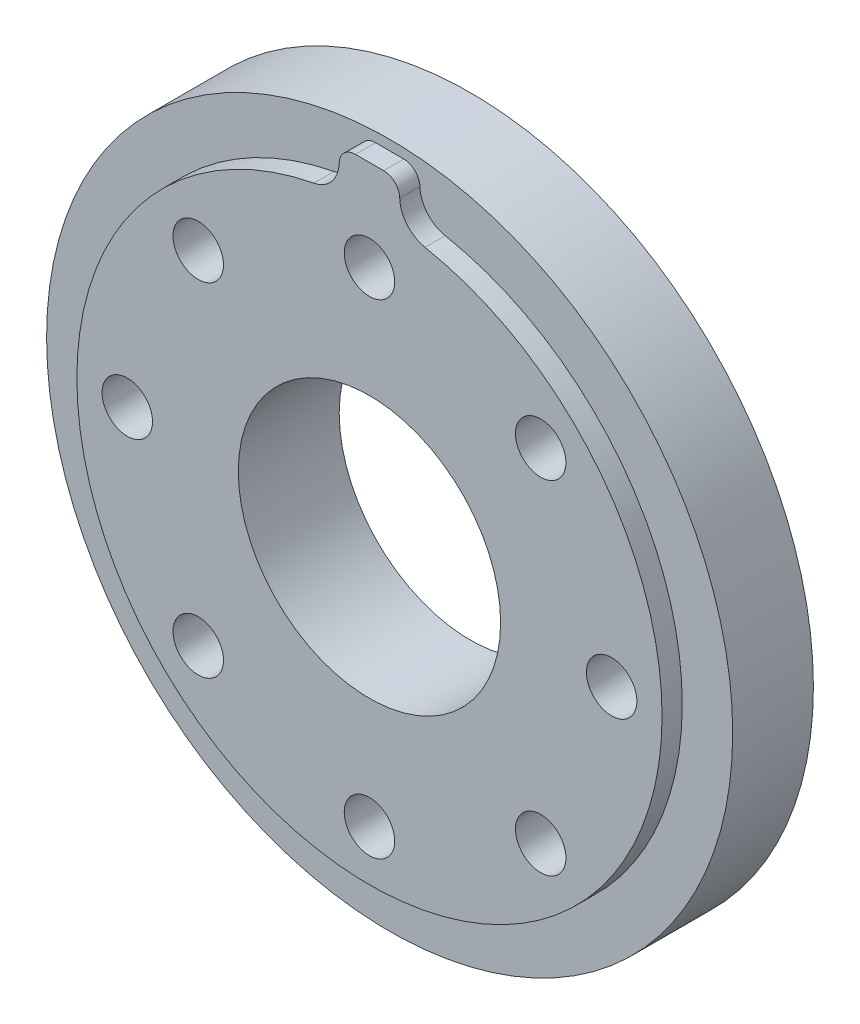
ISO-10303-21;
HEADER;
FILE_DESCRIPTION(('STEP AP214'),'2;1');
FILE_NAME('part.step','',(''),(''),'','','');
FILE_SCHEMA(('AUTOMOTIVE_DESIGN { 1 0 10303 214 1 1 1 1 }'));
ENDSEC;
DATA;
#1=APPLICATION_CONTEXT('core data for automotive mechanical design processes');
#2=APPLICATION_PROTOCOL_DEFINITION('international standard','automotive_design',2000,#1);
#3=PRODUCT_CONTEXT('',#1,'mechanical');
#4=PRODUCT('Part','Part','',(#3));
#5=PRODUCT_RELATED_PRODUCT_CATEGORY('part','',(#4));
#6=PRODUCT_DEFINITION_FORMATION('','',#4);
#7=PRODUCT_DEFINITION_CONTEXT('part definition',#1,'design');
#8=PRODUCT_DEFINITION('design','',#6,#7);
#9=PRODUCT_DEFINITION_SHAPE('','',#8);
#10=(LENGTH_UNIT() NAMED_UNIT(*) SI_UNIT(.MILLI.,.METRE.));
#11=(NAMED_UNIT(*) PLANE_ANGLE_UNIT() SI_UNIT($,.RADIAN.));
#12=(NAMED_UNIT(*) SI_UNIT($,.STERADIAN.) SOLID_ANGLE_UNIT());
#13=UNCERTAINTY_MEASURE_WITH_UNIT(LENGTH_MEASURE(1.E-05),#10,'distance_accuracy_value','');
#14=(GEOMETRIC_REPRESENTATION_CONTEXT(3) GLOBAL_UNCERTAINTY_ASSIGNED_CONTEXT((#13)) GLOBAL_UNIT_ASSIGNED_CONTEXT((#10,
#11,#12)) REPRESENTATION_CONTEXT('',''));
#15=CARTESIAN_POINT('',(0.,0.,0.));
#16=DIRECTION('',(0.,0.,1.));
#17=DIRECTION('',(1.,0.,0.));
#18=AXIS2_PLACEMENT_3D('',#15,#16,#17);
#19=CARTESIAN_POINT('',(0.,0.,4.));
#20=DIRECTION('',(0.,0.,-1.));
#21=DIRECTION('',(-1.,0.,0.));
#22=AXIS2_PLACEMENT_3D('',#19,#20,#21);
#23=CYLINDRICAL_SURFACE('',#22,17.);
#24=CARTESIAN_POINT('',(0.,0.,4.));
#25=DIRECTION('',(0.,0.,1.));
#26=DIRECTION('',(1.,0.,0.));
#27=AXIS2_PLACEMENT_3D('',#24,#25,#26);
#28=CIRCLE('',#27,17.);
#29=CARTESIAN_POINT('',(17.,0.,4.));
#30=VERTEX_POINT('',#29);
#31=EDGE_CURVE('E134',#30,#30,#28,.T.);
#32=ORIENTED_EDGE('',*,*,#31,.F.);
#33=EDGE_LOOP('',(#32));
#34=FACE_BOUND('',#33,.T.);
#35=CARTESIAN_POINT('',(0.,0.,0.));
#36=DIRECTION('',(0.,0.,1.));
#37=DIRECTION('',(1.,0.,0.));
#38=AXIS2_PLACEMENT_3D('',#35,#36,#37);
#39=CIRCLE('',#38,17.);
#40=CARTESIAN_POINT('',(17.,0.,0.));
#41=VERTEX_POINT('',#40);
#42=EDGE_CURVE('E138',#41,#41,#39,.T.);
#43=ORIENTED_EDGE('',*,*,#42,.T.);
#44=EDGE_LOOP('',(#43));
#45=FACE_BOUND('',#44,.T.);
#46=ADVANCED_FACE('F40',(#34,#45),#23,.T.);
#47=CARTESIAN_POINT('',(0.,0.,4.));
#48=DIRECTION('',(0.,0.,1.));
#49=DIRECTION('',(1.,0.,0.));
#50=AXIS2_PLACEMENT_3D('',#47,#48,#49);
#51=PLANE('',#50);
#52=CARTESIAN_POINT('',(0.,0.,4.));
#53=DIRECTION('',(0.,0.,1.));
#54=DIRECTION('',(1.,0.,0.));
#55=AXIS2_PLACEMENT_3D('',#52,#53,#54);
#56=CIRCLE('',#55,14.5);
#57=CARTESIAN_POINT('',(-2.75545171339564,14.2357818842221,4.));
#58=VERTEX_POINT('',#57);
#59=CARTESIAN_POINT('',(2.75545171339564,14.2357818842221,4.));
#60=VERTEX_POINT('',#59);
#61=EDGE_CURVE('E109',#58,#60,#56,.T.);
#62=ORIENTED_EDGE('',*,*,#61,.F.);
#63=CARTESIAN_POINT('',(-3.05,15.7575378787424,4.));
#64=DIRECTION('',(0.,0.,1.));
#65=DIRECTION('',(1.,0.,0.));
#66=AXIS2_PLACEMENT_3D('',#63,#64,#65);
#67=CIRCLE('',#66,1.55);
#68=CARTESIAN_POINT('',(-1.50046466372881,15.7195873629761,4.));
#69=VERTEX_POINT('',#68);
#70=EDGE_CURVE('E94',#58,#69,#67,.T.);
#71=ORIENTED_EDGE('',*,*,#70,.T.);
#72=CARTESIAN_POINT('',(-0.700704490169483,15.7,4.));
#73=DIRECTION('',(0.,0.,1.));
#74=DIRECTION('',(1.,0.,0.));
#75=AXIS2_PLACEMENT_3D('',#72,#73,#74);
#76=CIRCLE('',#75,0.8);
#77=CARTESIAN_POINT('',(-0.700704490169483,16.5,4.));
#78=VERTEX_POINT('',#77);
#79=EDGE_CURVE('E11',#69,#78,#76,.F.);
#80=ORIENTED_EDGE('',*,*,#79,.T.);
#81=DIRECTION('',(1.,0.,0.));
#82=VECTOR('',#81,1.);
#83=CARTESIAN_POINT('',(0.,16.5,4.));
#84=LINE('',#83,#82);
#85=CARTESIAN_POINT('',(0.700704490169483,16.5,4.));
#86=VERTEX_POINT('',#85);
#87=EDGE_CURVE('E120',#78,#86,#84,.T.);
#88=ORIENTED_EDGE('',*,*,#87,.T.);
#89=CARTESIAN_POINT('',(0.700704490169483,15.7,4.));
#90=DIRECTION('',(0.,0.,1.));
#91=DIRECTION('',(1.,0.,0.));
#92=AXIS2_PLACEMENT_3D('',#89,#90,#91);
#93=CIRCLE('',#92,0.8);
#94=CARTESIAN_POINT('',(1.50046466372881,15.7195873629761,4.));
#95=VERTEX_POINT('',#94);
#96=EDGE_CURVE('E49',#86,#95,#93,.F.);
#97=ORIENTED_EDGE('',*,*,#96,.T.);
#98=CARTESIAN_POINT('',(3.05,15.7575378787424,4.));
#99=DIRECTION('',(0.,0.,1.));
#100=DIRECTION('',(1.,0.,0.));
#101=AXIS2_PLACEMENT_3D('',#98,#99,#100);
#102=CIRCLE('',#101,1.55);
#103=EDGE_CURVE('E103',#95,#60,#102,.T.);
#104=ORIENTED_EDGE('',*,*,#103,.T.);
#105=EDGE_LOOP('',(#62,#71,#80,#88,#97,#104));
#106=FACE_BOUND('',#105,.T.);
#107=ORIENTED_EDGE('',*,*,#31,.T.);
#108=EDGE_LOOP('',(#107));
#109=FACE_BOUND('',#108,.T.);
#110=ADVANCED_FACE('F116',(#106,#109),#51,.T.);
#111=CARTESIAN_POINT('',(0.,0.,0.));
#112=DIRECTION('',(0.,0.,1.));
#113=DIRECTION('',(1.,0.,0.));
#114=AXIS2_PLACEMENT_3D('',#111,#112,#113);
#115=PLANE('',#114);
#116=CARTESIAN_POINT('',(8.48528137423856,8.48528137423808,0.));
#117=DIRECTION('',(0.,0.,-1.));
#118=DIRECTION('',(-0.707106781186546,-0.707106781186549,0.));
#119=AXIS2_PLACEMENT_3D('',#116,#117,#118);
#120=CIRCLE('',#119,1.25);
#121=CARTESIAN_POINT('',(7.60139789775538,7.6013978977549,0.));
#122=VERTEX_POINT('',#121);
#123=EDGE_CURVE('E229',#122,#122,#120,.T.);
#124=ORIENTED_EDGE('',*,*,#123,.F.);
#125=EDGE_LOOP('',(#124));
#126=FACE_BOUND('',#125,.T.);
#127=CARTESIAN_POINT('',(8.48528137423809,-8.48528137423906,0.));
#128=DIRECTION('',(0.,0.,-1.));
#129=DIRECTION('',(-0.707106781186546,-0.707106781186549,0.));
#130=AXIS2_PLACEMENT_3D('',#127,#128,#129);
#131=CIRCLE('',#130,1.25);
#132=CARTESIAN_POINT('',(7.6013978977549,-9.36916485072224,0.));
#133=VERTEX_POINT('',#132);
#134=EDGE_CURVE('E237',#133,#133,#131,.T.);
#135=ORIENTED_EDGE('',*,*,#134,.F.);
#136=EDGE_LOOP('',(#135));
#137=FACE_BOUND('',#136,.T.);
#138=CARTESIAN_POINT('',(-8.48528137423906,-8.48528137423859,0.));
#139=DIRECTION('',(0.,0.,-1.));
#140=DIRECTION('',(-0.707106781186546,-0.707106781186549,0.));
#141=AXIS2_PLACEMENT_3D('',#138,#139,#140);
#142=CIRCLE('',#141,1.25);
#143=CARTESIAN_POINT('',(-9.36916485072224,-9.36916485072177,0.));
#144=VERTEX_POINT('',#143);
#145=EDGE_CURVE('E245',#144,#144,#142,.T.);
#146=ORIENTED_EDGE('',*,*,#145,.F.);
#147=EDGE_LOOP('',(#146));
#148=FACE_BOUND('',#147,.T.);
#149=CARTESIAN_POINT('',(-8.48528137423859,8.48528137423856,0.));
#150=DIRECTION('',(0.,0.,-1.));
#151=DIRECTION('',(-0.707106781186546,-0.707106781186549,0.));
#152=AXIS2_PLACEMENT_3D('',#149,#150,#151);
#153=CIRCLE('',#152,1.25);
#154=CARTESIAN_POINT('',(-9.36916485072177,7.60139789775537,0.));
#155=VERTEX_POINT('',#154);
#156=EDGE_CURVE('E221',#155,#155,#153,.T.);
#157=ORIENTED_EDGE('',*,*,#156,.F.);
#158=EDGE_LOOP('',(#157));
#159=FACE_BOUND('',#158,.T.);
#160=CARTESIAN_POINT('',(0.,12.,0.));
#161=DIRECTION('',(0.,0.,-1.));
#162=DIRECTION('',(-1.,0.,0.));
#163=AXIS2_PLACEMENT_3D('',#160,#161,#162);
#164=CIRCLE('',#163,1.25);
#165=CARTESIAN_POINT('',(-1.25,12.,0.));
#166=VERTEX_POINT('',#165);
#167=EDGE_CURVE('E214',#166,#166,#164,.T.);
#168=ORIENTED_EDGE('',*,*,#167,.F.);
#169=EDGE_LOOP('',(#168));
#170=FACE_BOUND('',#169,.T.);
#171=CARTESIAN_POINT('',(-12.0000000000004,3.53709943211137E-13,0.));
#172=DIRECTION('',(0.,0.,-1.));
#173=DIRECTION('',(-1.,0.,0.));
#174=AXIS2_PLACEMENT_3D('',#171,#172,#173);
#175=CIRCLE('',#174,1.25);
#176=CARTESIAN_POINT('',(-13.2500000000004,3.53709943211137E-13,0.));
#177=VERTEX_POINT('',#176);
#178=EDGE_CURVE('E206',#177,#177,#175,.T.);
#179=ORIENTED_EDGE('',*,*,#178,.F.);
#180=EDGE_LOOP('',(#179));
#181=FACE_BOUND('',#180,.T.);
#182=CARTESIAN_POINT('',(-7.07419886422274E-13,-12.,0.));
#183=DIRECTION('',(0.,0.,-1.));
#184=DIRECTION('',(-1.,0.,0.));
#185=AXIS2_PLACEMENT_3D('',#182,#183,#184);
#186=CIRCLE('',#185,1.25);
#187=CARTESIAN_POINT('',(-1.25000000000071,-12.,0.));
#188=VERTEX_POINT('',#187);
#189=EDGE_CURVE('E198',#188,#188,#186,.T.);
#190=ORIENTED_EDGE('',*,*,#189,.F.);
#191=EDGE_LOOP('',(#190));
#192=FACE_BOUND('',#191,.T.);
#193=CARTESIAN_POINT('',(11.9999999999996,-3.55179519370114E-13,0.));
#194=DIRECTION('',(0.,0.,-1.));
#195=DIRECTION('',(-1.,0.,0.));
#196=AXIS2_PLACEMENT_3D('',#193,#194,#195);
#197=CIRCLE('',#196,1.25);
#198=CARTESIAN_POINT('',(10.7499999999996,-3.55179519370114E-13,0.));
#199=VERTEX_POINT('',#198);
#200=EDGE_CURVE('E189',#199,#199,#197,.T.);
#201=ORIENTED_EDGE('',*,*,#200,.F.);
#202=EDGE_LOOP('',(#201));
#203=FACE_BOUND('',#202,.T.);
#204=CARTESIAN_POINT('',(0.,0.,0.));
#205=DIRECTION('',(0.,0.,1.));
#206=DIRECTION('',(1.,0.,0.));
#207=AXIS2_PLACEMENT_3D('',#204,#205,#206);
#208=CIRCLE('',#207,6.5);
#209=CARTESIAN_POINT('',(6.5,0.,0.));
#210=VERTEX_POINT('',#209);
#211=EDGE_CURVE('E121',#210,#210,#208,.T.);
#212=ORIENTED_EDGE('',*,*,#211,.T.);
#213=EDGE_LOOP('',(#212));
#214=FACE_BOUND('',#213,.T.);
#215=ORIENTED_EDGE('',*,*,#42,.F.);
#216=EDGE_LOOP('',(#215));
#217=FACE_BOUND('',#216,.T.);
#218=ADVANCED_FACE('F263',(#126,#137,#148,#159,#170,#181,#192,#203,#214,#217),#115,.F.);
#219=CARTESIAN_POINT('',(0.,0.,5.));
#220=DIRECTION('',(0.,0.,-1.));
#221=DIRECTION('',(-1.,0.,0.));
#222=AXIS2_PLACEMENT_3D('',#219,#220,#221);
#223=CYLINDRICAL_SURFACE('',#222,14.5);
#224=CARTESIAN_POINT('',(0.,0.,5.));
#225=DIRECTION('',(0.,0.,1.));
#226=DIRECTION('',(1.,0.,0.));
#227=AXIS2_PLACEMENT_3D('',#224,#225,#226);
#228=CIRCLE('',#227,14.5);
#229=CARTESIAN_POINT('',(-2.75545171339564,14.2357818842221,5.));
#230=VERTEX_POINT('',#229);
#231=CARTESIAN_POINT('',(2.75545171339564,14.2357818842221,5.));
#232=VERTEX_POINT('',#231);
#233=EDGE_CURVE('E112',#230,#232,#228,.T.);
#234=ORIENTED_EDGE('',*,*,#233,.F.);
#235=DIRECTION('',(0.,0.,-1.));
#236=VECTOR('',#235,1.);
#237=CARTESIAN_POINT('',(-2.75545171339564,14.2357818842221,5.));
#238=LINE('',#237,#236);
#239=EDGE_CURVE('E97',#230,#58,#238,.T.);
#240=ORIENTED_EDGE('',*,*,#239,.T.);
#241=ORIENTED_EDGE('',*,*,#61,.T.);
#242=DIRECTION('',(0.,0.,-1.));
#243=VECTOR('',#242,1.);
#244=CARTESIAN_POINT('',(2.75545171339564,14.2357818842221,5.));
#245=LINE('',#244,#243);
#246=EDGE_CURVE('E114',#60,#232,#245,.F.);
#247=ORIENTED_EDGE('',*,*,#246,.T.);
#248=EDGE_LOOP('',(#234,#240,#241,#247));
#249=FACE_BOUND('',#248,.T.);
#250=ADVANCED_FACE('F108',(#249),#223,.T.);
#251=CARTESIAN_POINT('',(0.,16.5,5.));
#252=DIRECTION('',(0.,1.,0.));
#253=DIRECTION('',(0.,0.,1.));
#254=AXIS2_PLACEMENT_3D('',#251,#252,#253);
#255=PLANE('',#254);
#256=DIRECTION('',(1.,0.,0.));
#257=VECTOR('',#256,1.);
#258=CARTESIAN_POINT('',(0.,16.5,5.));
#259=LINE('',#258,#257);
#260=CARTESIAN_POINT('',(-0.700704490169483,16.5,5.));
#261=VERTEX_POINT('',#260);
#262=CARTESIAN_POINT('',(0.700704490169483,16.5,5.));
#263=VERTEX_POINT('',#262);
#264=EDGE_CURVE('E131',#261,#263,#259,.T.);
#265=ORIENTED_EDGE('',*,*,#264,.T.);
#266=DIRECTION('',(0.,0.,1.));
#267=VECTOR('',#266,1.);
#268=CARTESIAN_POINT('',(0.700704490169483,16.5,4.));
#269=LINE('',#268,#267);
#270=EDGE_CURVE('E155',#263,#86,#269,.F.);
#271=ORIENTED_EDGE('',*,*,#270,.T.);
#272=ORIENTED_EDGE('',*,*,#87,.F.);
#273=DIRECTION('',(0.,0.,1.));
#274=VECTOR('',#273,1.);
#275=CARTESIAN_POINT('',(-0.700704490169483,16.5,5.));
#276=LINE('',#275,#274);
#277=EDGE_CURVE('E152',#78,#261,#276,.T.);
#278=ORIENTED_EDGE('',*,*,#277,.T.);
#279=EDGE_LOOP('',(#265,#271,#272,#278));
#280=FACE_BOUND('',#279,.T.);
#281=ADVANCED_FACE('F181',(#280),#255,.T.);
#282=CARTESIAN_POINT('',(0.,0.,5.));
#283=DIRECTION('',(0.,0.,1.));
#284=DIRECTION('',(1.,0.,0.));
#285=AXIS2_PLACEMENT_3D('',#282,#283,#284);
#286=PLANE('',#285);
#287=CARTESIAN_POINT('',(8.48528137423856,8.48528137423808,5.));
#288=DIRECTION('',(0.,0.,-1.));
#289=DIRECTION('',(-0.707106781186546,-0.707106781186549,0.));
#290=AXIS2_PLACEMENT_3D('',#287,#288,#289);
#291=CIRCLE('',#290,1.25);
#292=CARTESIAN_POINT('',(7.60139789775538,7.6013978977549,5.));
#293=VERTEX_POINT('',#292);
#294=EDGE_CURVE('E233',#293,#293,#291,.T.);
#295=ORIENTED_EDGE('',*,*,#294,.T.);
#296=EDGE_LOOP('',(#295));
#297=FACE_BOUND('',#296,.T.);
#298=CARTESIAN_POINT('',(8.48528137423809,-8.48528137423906,5.));
#299=DIRECTION('',(0.,0.,-1.));
#300=DIRECTION('',(-0.707106781186546,-0.707106781186549,0.));
#301=AXIS2_PLACEMENT_3D('',#298,#299,#300);
#302=CIRCLE('',#301,1.25);
#303=CARTESIAN_POINT('',(7.6013978977549,-9.36916485072224,5.));
#304=VERTEX_POINT('',#303);
#305=EDGE_CURVE('E241',#304,#304,#302,.T.);
#306=ORIENTED_EDGE('',*,*,#305,.T.);
#307=EDGE_LOOP('',(#306));
#308=FACE_BOUND('',#307,.T.);
#309=CARTESIAN_POINT('',(-8.48528137423906,-8.48528137423859,5.));
#310=DIRECTION('',(0.,0.,-1.));
#311=DIRECTION('',(-0.707106781186546,-0.707106781186549,0.));
#312=AXIS2_PLACEMENT_3D('',#309,#310,#311);
#313=CIRCLE('',#312,1.25);
#314=CARTESIAN_POINT('',(-9.36916485072224,-9.36916485072177,5.));
#315=VERTEX_POINT('',#314);
#316=EDGE_CURVE('E225',#315,#315,#313,.T.);
#317=ORIENTED_EDGE('',*,*,#316,.T.);
#318=EDGE_LOOP('',(#317));
#319=FACE_BOUND('',#318,.T.);
#320=CARTESIAN_POINT('',(-8.48528137423859,8.48528137423856,5.));
#321=DIRECTION('',(0.,0.,-1.));
#322=DIRECTION('',(-0.707106781186546,-0.707106781186549,0.));
#323=AXIS2_PLACEMENT_3D('',#320,#321,#322);
#324=CIRCLE('',#323,1.25);
#325=CARTESIAN_POINT('',(-9.36916485072177,7.60139789775537,5.));
#326=VERTEX_POINT('',#325);
#327=EDGE_CURVE('E194',#326,#326,#324,.T.);
#328=ORIENTED_EDGE('',*,*,#327,.T.);
#329=EDGE_LOOP('',(#328));
#330=FACE_BOUND('',#329,.T.);
#331=CARTESIAN_POINT('',(0.,12.,5.));
#332=DIRECTION('',(0.,0.,-1.));
#333=DIRECTION('',(-1.,0.,0.));
#334=AXIS2_PLACEMENT_3D('',#331,#332,#333);
#335=CIRCLE('',#334,1.25);
#336=CARTESIAN_POINT('',(-1.25,12.,5.));
#337=VERTEX_POINT('',#336);
#338=EDGE_CURVE('E187',#337,#337,#335,.T.);
#339=ORIENTED_EDGE('',*,*,#338,.T.);
#340=EDGE_LOOP('',(#339));
#341=FACE_BOUND('',#340,.T.);
#342=CARTESIAN_POINT('',(-12.0000000000004,3.53709943211137E-13,5.));
#343=DIRECTION('',(0.,0.,-1.));
#344=DIRECTION('',(-1.,0.,0.));
#345=AXIS2_PLACEMENT_3D('',#342,#343,#344);
#346=CIRCLE('',#345,1.25);
#347=CARTESIAN_POINT('',(-13.2500000000004,3.53709943211137E-13,5.));
#348=VERTEX_POINT('',#347);
#349=EDGE_CURVE('E210',#348,#348,#346,.T.);
#350=ORIENTED_EDGE('',*,*,#349,.T.);
#351=EDGE_LOOP('',(#350));
#352=FACE_BOUND('',#351,.T.);
#353=CARTESIAN_POINT('',(-7.07419886422274E-13,-12.,5.));
#354=DIRECTION('',(0.,0.,-1.));
#355=DIRECTION('',(-1.,0.,0.));
#356=AXIS2_PLACEMENT_3D('',#353,#354,#355);
#357=CIRCLE('',#356,1.25);
#358=CARTESIAN_POINT('',(-1.25000000000071,-12.,5.));
#359=VERTEX_POINT('',#358);
#360=EDGE_CURVE('E202',#359,#359,#357,.T.);
#361=ORIENTED_EDGE('',*,*,#360,.T.);
#362=EDGE_LOOP('',(#361));
#363=FACE_BOUND('',#362,.T.);
#364=CARTESIAN_POINT('',(11.9999999999996,-3.55179519370114E-13,5.));
#365=DIRECTION('',(0.,0.,-1.));
#366=DIRECTION('',(-1.,0.,0.));
#367=AXIS2_PLACEMENT_3D('',#364,#365,#366);
#368=CIRCLE('',#367,1.25);
#369=CARTESIAN_POINT('',(10.7499999999996,-3.55179519370114E-13,5.));
#370=VERTEX_POINT('',#369);
#371=EDGE_CURVE('E193',#370,#370,#368,.T.);
#372=ORIENTED_EDGE('',*,*,#371,.T.);
#373=EDGE_LOOP('',(#372));
#374=FACE_BOUND('',#373,.T.);
#375=CARTESIAN_POINT('',(0.,0.,5.));
#376=DIRECTION('',(0.,0.,1.));
#377=DIRECTION('',(1.,0.,0.));
#378=AXIS2_PLACEMENT_3D('',#375,#376,#377);
#379=CIRCLE('',#378,6.5);
#380=CARTESIAN_POINT('',(6.5,0.,5.));
#381=VERTEX_POINT('',#380);
#382=EDGE_CURVE('E128',#381,#381,#379,.T.);
#383=ORIENTED_EDGE('',*,*,#382,.F.);
#384=EDGE_LOOP('',(#383));
#385=FACE_BOUND('',#384,.T.);
#386=CARTESIAN_POINT('',(3.05,15.7575378787424,5.));
#387=DIRECTION('',(0.,0.,1.));
#388=DIRECTION('',(1.,0.,0.));
#389=AXIS2_PLACEMENT_3D('',#386,#387,#388);
#390=CIRCLE('',#389,1.55);
#391=CARTESIAN_POINT('',(1.50046466372881,15.7195873629761,5.));
#392=VERTEX_POINT('',#391);
#393=EDGE_CURVE('E148',#232,#392,#390,.F.);
#394=ORIENTED_EDGE('',*,*,#393,.T.);
#395=CARTESIAN_POINT('',(0.700704490169483,15.7,5.));
#396=DIRECTION('',(0.,0.,1.));
#397=DIRECTION('',(1.,0.,0.));
#398=AXIS2_PLACEMENT_3D('',#395,#396,#397);
#399=CIRCLE('',#398,0.8);
#400=EDGE_CURVE('E164',#392,#263,#399,.T.);
#401=ORIENTED_EDGE('',*,*,#400,.T.);
#402=ORIENTED_EDGE('',*,*,#264,.F.);
#403=CARTESIAN_POINT('',(-0.700704490169483,15.7,5.));
#404=DIRECTION('',(0.,0.,1.));
#405=DIRECTION('',(1.,0.,0.));
#406=AXIS2_PLACEMENT_3D('',#403,#404,#405);
#407=CIRCLE('',#406,0.8);
#408=CARTESIAN_POINT('',(-1.50046466372881,15.7195873629761,5.));
#409=VERTEX_POINT('',#408);
#410=EDGE_CURVE('E62',#261,#409,#407,.T.);
#411=ORIENTED_EDGE('',*,*,#410,.T.);
#412=CARTESIAN_POINT('',(-3.05,15.7575378787424,5.));
#413=DIRECTION('',(0.,0.,1.));
#414=DIRECTION('',(1.,0.,0.));
#415=AXIS2_PLACEMENT_3D('',#412,#413,#414);
#416=CIRCLE('',#415,1.55);
#417=EDGE_CURVE('E102',#409,#230,#416,.F.);
#418=ORIENTED_EDGE('',*,*,#417,.T.);
#419=ORIENTED_EDGE('',*,*,#233,.T.);
#420=EDGE_LOOP('',(#394,#401,#402,#411,#418,#419));
#421=FACE_BOUND('',#420,.T.);
#422=ADVANCED_FACE('F179',(#297,#308,#319,#330,#341,#352,#363,#374,#385,#421),#286,.T.);
#423=CARTESIAN_POINT('',(-3.05,15.7575378787424,5.));
#424=DIRECTION('',(0.,0.,-1.));
#425=DIRECTION('',(-1.,0.,0.));
#426=AXIS2_PLACEMENT_3D('',#423,#424,#425);
#427=CYLINDRICAL_SURFACE('',#426,1.55);
#428=ORIENTED_EDGE('',*,*,#417,.F.);
#429=DIRECTION('',(0.,0.,-1.));
#430=VECTOR('',#429,1.);
#431=CARTESIAN_POINT('',(-1.50046466372881,15.7195873629761,5.));
#432=LINE('',#431,#430);
#433=EDGE_CURVE('E98',#409,#69,#432,.T.);
#434=ORIENTED_EDGE('',*,*,#433,.T.);
#435=ORIENTED_EDGE('',*,*,#70,.F.);
#436=ORIENTED_EDGE('',*,*,#239,.F.);
#437=EDGE_LOOP('',(#428,#434,#435,#436));
#438=FACE_BOUND('',#437,.T.);
#439=ADVANCED_FACE('F96',(#438),#427,.F.);
#440=CARTESIAN_POINT('',(3.05,15.7575378787424,5.));
#441=DIRECTION('',(0.,0.,-1.));
#442=DIRECTION('',(-1.,0.,0.));
#443=AXIS2_PLACEMENT_3D('',#440,#441,#442);
#444=CYLINDRICAL_SURFACE('',#443,1.55);
#445=ORIENTED_EDGE('',*,*,#103,.F.);
#446=DIRECTION('',(0.,0.,-1.));
#447=VECTOR('',#446,1.);
#448=CARTESIAN_POINT('',(1.50046466372881,15.7195873629761,5.));
#449=LINE('',#448,#447);
#450=EDGE_CURVE('E159',#95,#392,#449,.F.);
#451=ORIENTED_EDGE('',*,*,#450,.T.);
#452=ORIENTED_EDGE('',*,*,#393,.F.);
#453=ORIENTED_EDGE('',*,*,#246,.F.);
#454=EDGE_LOOP('',(#445,#451,#452,#453));
#455=FACE_BOUND('',#454,.T.);
#456=ADVANCED_FACE('F174',(#455),#444,.F.);
#457=CARTESIAN_POINT('',(0.700704490169483,15.7,5.));
#458=DIRECTION('',(0.,0.,-1.));
#459=DIRECTION('',(-1.,0.,0.));
#460=AXIS2_PLACEMENT_3D('',#457,#458,#459);
#461=CYLINDRICAL_SURFACE('',#460,0.8);
#462=ORIENTED_EDGE('',*,*,#400,.F.);
#463=ORIENTED_EDGE('',*,*,#450,.F.);
#464=ORIENTED_EDGE('',*,*,#96,.F.);
#465=ORIENTED_EDGE('',*,*,#270,.F.);
#466=EDGE_LOOP('',(#462,#463,#464,#465));
#467=FACE_BOUND('',#466,.T.);
#468=ADVANCED_FACE('F177',(#467),#461,.T.);
#469=CARTESIAN_POINT('',(-0.700704490169483,15.7,5.));
#470=DIRECTION('',(0.,0.,-1.));
#471=DIRECTION('',(-1.,0.,0.));
#472=AXIS2_PLACEMENT_3D('',#469,#470,#471);
#473=CYLINDRICAL_SURFACE('',#472,0.8);
#474=ORIENTED_EDGE('',*,*,#410,.F.);
#475=ORIENTED_EDGE('',*,*,#277,.F.);
#476=ORIENTED_EDGE('',*,*,#79,.F.);
#477=ORIENTED_EDGE('',*,*,#433,.F.);
#478=EDGE_LOOP('',(#474,#475,#476,#477));
#479=FACE_BOUND('',#478,.T.);
#480=ADVANCED_FACE('F42',(#479),#473,.T.);
#481=CARTESIAN_POINT('',(0.,0.,0.));
#482=DIRECTION('',(0.,0.,1.));
#483=DIRECTION('',(1.,0.,0.));
#484=AXIS2_PLACEMENT_3D('',#481,#482,#483);
#485=CYLINDRICAL_SURFACE('',#484,6.5);
#486=ORIENTED_EDGE('',*,*,#211,.F.);
#487=EDGE_LOOP('',(#486));
#488=FACE_BOUND('',#487,.T.);
#489=ORIENTED_EDGE('',*,*,#382,.T.);
#490=EDGE_LOOP('',(#489));
#491=FACE_BOUND('',#490,.T.);
#492=ADVANCED_FACE('F298',(#488,#491),#485,.F.);
#493=CARTESIAN_POINT('',(11.9999999999996,-3.55179519370114E-13,5.));
#494=DIRECTION('',(0.,0.,-1.));
#495=DIRECTION('',(-1.,0.,0.));
#496=AXIS2_PLACEMENT_3D('',#493,#494,#495);
#497=CYLINDRICAL_SURFACE('',#496,1.25);
#498=ORIENTED_EDGE('',*,*,#371,.F.);
#499=EDGE_LOOP('',(#498));
#500=FACE_BOUND('',#499,.T.);
#501=ORIENTED_EDGE('',*,*,#200,.T.);
#502=EDGE_LOOP('',(#501));
#503=FACE_BOUND('',#502,.T.);
#504=ADVANCED_FACE('F302',(#500,#503),#497,.F.);
#505=CARTESIAN_POINT('',(-7.07419886422274E-13,-12.,5.));
#506=DIRECTION('',(0.,0.,-1.));
#507=DIRECTION('',(-1.,0.,0.));
#508=AXIS2_PLACEMENT_3D('',#505,#506,#507);
#509=CYLINDRICAL_SURFACE('',#508,1.25);
#510=ORIENTED_EDGE('',*,*,#360,.F.);
#511=EDGE_LOOP('',(#510));
#512=FACE_BOUND('',#511,.T.);
#513=ORIENTED_EDGE('',*,*,#189,.T.);
#514=EDGE_LOOP('',(#513));
#515=FACE_BOUND('',#514,.T.);
#516=ADVANCED_FACE('F308',(#512,#515),#509,.F.);
#517=CARTESIAN_POINT('',(-12.0000000000004,3.53709943211137E-13,5.));
#518=DIRECTION('',(0.,0.,-1.));
#519=DIRECTION('',(-1.,0.,0.));
#520=AXIS2_PLACEMENT_3D('',#517,#518,#519);
#521=CYLINDRICAL_SURFACE('',#520,1.25);
#522=ORIENTED_EDGE('',*,*,#349,.F.);
#523=EDGE_LOOP('',(#522));
#524=FACE_BOUND('',#523,.T.);
#525=ORIENTED_EDGE('',*,*,#178,.T.);
#526=EDGE_LOOP('',(#525));
#527=FACE_BOUND('',#526,.T.);
#528=ADVANCED_FACE('F373',(#524,#527),#521,.F.);
#529=CARTESIAN_POINT('',(0.,12.,5.));
#530=DIRECTION('',(0.,0.,-1.));
#531=DIRECTION('',(-1.,0.,0.));
#532=AXIS2_PLACEMENT_3D('',#529,#530,#531);
#533=CYLINDRICAL_SURFACE('',#532,1.25);
#534=ORIENTED_EDGE('',*,*,#338,.F.);
#535=EDGE_LOOP('',(#534));
#536=FACE_BOUND('',#535,.T.);
#537=ORIENTED_EDGE('',*,*,#167,.T.);
#538=EDGE_LOOP('',(#537));
#539=FACE_BOUND('',#538,.T.);
#540=ADVANCED_FACE('F382',(#536,#539),#533,.F.);
#541=CARTESIAN_POINT('',(-8.48528137423859,8.48528137423856,5.));
#542=DIRECTION('',(0.,0.,-1.));
#543=DIRECTION('',(-1.,0.,0.));
#544=AXIS2_PLACEMENT_3D('',#541,#542,#543);
#545=CYLINDRICAL_SURFACE('',#544,1.25);
#546=ORIENTED_EDGE('',*,*,#327,.F.);
#547=EDGE_LOOP('',(#546));
#548=FACE_BOUND('',#547,.T.);
#549=ORIENTED_EDGE('',*,*,#156,.T.);
#550=EDGE_LOOP('',(#549));
#551=FACE_BOUND('',#550,.T.);
#552=ADVANCED_FACE('F259',(#548,#551),#545,.F.);
#553=CARTESIAN_POINT('',(-8.48528137423906,-8.48528137423859,5.));
#554=DIRECTION('',(0.,0.,-1.));
#555=DIRECTION('',(-1.,0.,0.));
#556=AXIS2_PLACEMENT_3D('',#553,#554,#555);
#557=CYLINDRICAL_SURFACE('',#556,1.25);
#558=ORIENTED_EDGE('',*,*,#316,.F.);
#559=EDGE_LOOP('',(#558));
#560=FACE_BOUND('',#559,.T.);
#561=ORIENTED_EDGE('',*,*,#145,.T.);
#562=EDGE_LOOP('',(#561));
#563=FACE_BOUND('',#562,.T.);
#564=ADVANCED_FACE('F255',(#560,#563),#557,.F.);
#565=CARTESIAN_POINT('',(8.48528137423809,-8.48528137423906,5.));
#566=DIRECTION('',(0.,0.,-1.));
#567=DIRECTION('',(-1.,0.,0.));
#568=AXIS2_PLACEMENT_3D('',#565,#566,#567);
#569=CYLINDRICAL_SURFACE('',#568,1.25);
#570=ORIENTED_EDGE('',*,*,#305,.F.);
#571=EDGE_LOOP('',(#570));
#572=FACE_BOUND('',#571,.T.);
#573=ORIENTED_EDGE('',*,*,#134,.T.);
#574=EDGE_LOOP('',(#573));
#575=FACE_BOUND('',#574,.T.);
#576=ADVANCED_FACE('F258',(#572,#575),#569,.F.);
#577=CARTESIAN_POINT('',(8.48528137423856,8.48528137423808,5.));
#578=DIRECTION('',(0.,0.,-1.));
#579=DIRECTION('',(-1.,0.,0.));
#580=AXIS2_PLACEMENT_3D('',#577,#578,#579);
#581=CYLINDRICAL_SURFACE('',#580,1.25);
#582=ORIENTED_EDGE('',*,*,#294,.F.);
#583=EDGE_LOOP('',(#582));
#584=FACE_BOUND('',#583,.T.);
#585=ORIENTED_EDGE('',*,*,#123,.T.);
#586=EDGE_LOOP('',(#585));
#587=FACE_BOUND('',#586,.T.);
#588=ADVANCED_FACE('F411',(#584,#587),#581,.F.);
#589=CLOSED_SHELL('',(#46,#110,#218,#250,#281,#422,#439,#456,#468,#480,#492,#504,#516,#528,#540,
#552,#564,#576,#588));
#590=MANIFOLD_SOLID_BREP('B2',#589);
#591=ADVANCED_BREP_SHAPE_REPRESENTATION('',(#18,#590),#14);
#592=SHAPE_DEFINITION_REPRESENTATION(#9,#591);
ENDSEC;
END-ISO-10303-21;
